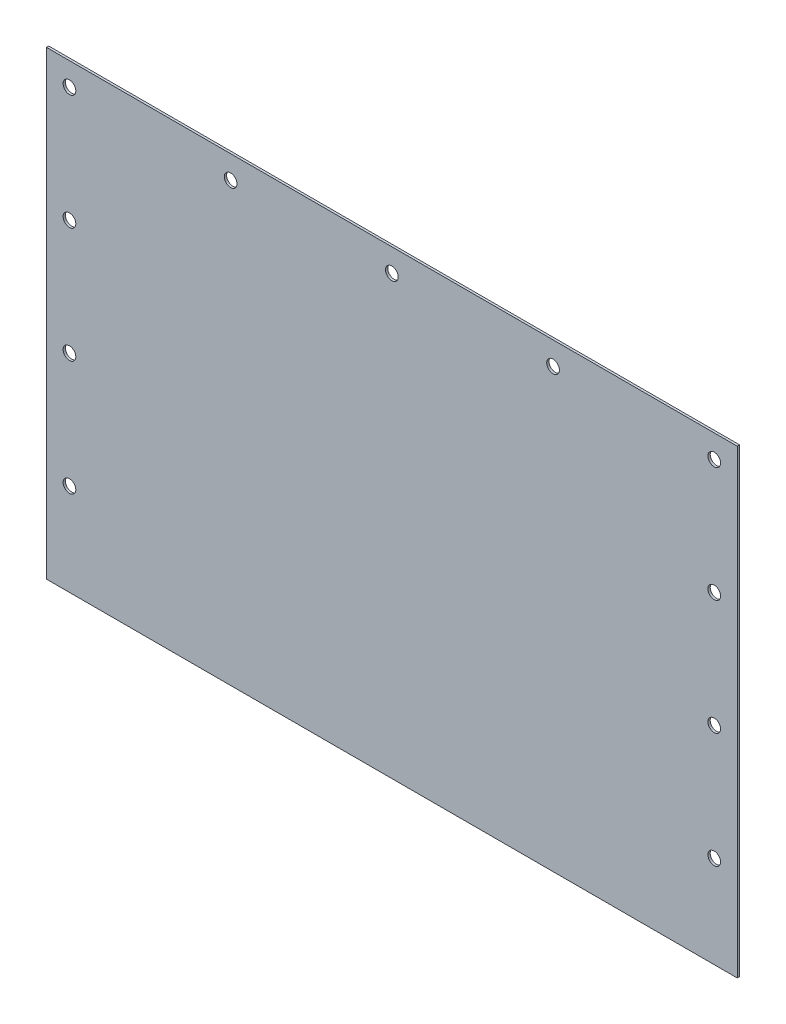
ISO-10303-21;
HEADER;
FILE_DESCRIPTION(('STEP AP214'),'2;1');
FILE_NAME('part.step','',(''),(''),'','','');
FILE_SCHEMA(('AUTOMOTIVE_DESIGN { 1 0 10303 214 1 1 1 1 }'));
ENDSEC;
DATA;
#1=APPLICATION_CONTEXT('core data for automotive mechanical design processes');
#2=APPLICATION_PROTOCOL_DEFINITION('international standard','automotive_design',2000,#1);
#3=PRODUCT_CONTEXT('',#1,'mechanical');
#4=PRODUCT('Part','Part','',(#3));
#5=PRODUCT_RELATED_PRODUCT_CATEGORY('part','',(#4));
#6=PRODUCT_DEFINITION_FORMATION('','',#4);
#7=PRODUCT_DEFINITION_CONTEXT('part definition',#1,'design');
#8=PRODUCT_DEFINITION('design','',#6,#7);
#9=PRODUCT_DEFINITION_SHAPE('','',#8);
#10=(LENGTH_UNIT() NAMED_UNIT(*) SI_UNIT(.MILLI.,.METRE.));
#11=(NAMED_UNIT(*) PLANE_ANGLE_UNIT() SI_UNIT($,.RADIAN.));
#12=(NAMED_UNIT(*) SI_UNIT($,.STERADIAN.) SOLID_ANGLE_UNIT());
#13=UNCERTAINTY_MEASURE_WITH_UNIT(LENGTH_MEASURE(1.E-05),#10,'distance_accuracy_value','');
#14=(GEOMETRIC_REPRESENTATION_CONTEXT(3) GLOBAL_UNCERTAINTY_ASSIGNED_CONTEXT((#13)) GLOBAL_UNIT_ASSIGNED_CONTEXT((#10,
#11,#12)) REPRESENTATION_CONTEXT('',''));
#15=CARTESIAN_POINT('',(0.,0.,0.));
#16=DIRECTION('',(0.,0.,1.));
#17=DIRECTION('',(1.,0.,0.));
#18=AXIS2_PLACEMENT_3D('',#15,#16,#17);
#19=CARTESIAN_POINT('',(-150.,-110.,1.));
#20=DIRECTION('',(-1.,0.,0.));
#21=DIRECTION('',(0.,0.,1.));
#22=AXIS2_PLACEMENT_3D('',#19,#20,#21);
#23=PLANE('',#22);
#24=DIRECTION('',(0.,0.,1.));
#25=VECTOR('',#24,1.);
#26=CARTESIAN_POINT('',(-150.,-89.9999999999999,-9.));
#27=LINE('',#26,#25);
#28=CARTESIAN_POINT('',(-150.,-89.9999999999999,0.));
#29=VERTEX_POINT('',#28);
#30=CARTESIAN_POINT('',(-150.,-89.9999999999999,1.));
#31=VERTEX_POINT('',#30);
#32=EDGE_CURVE('E50',#29,#31,#27,.T.);
#33=ORIENTED_EDGE('',*,*,#32,.T.);
#34=DIRECTION('',(0.,1.,0.));
#35=VECTOR('',#34,1.);
#36=CARTESIAN_POINT('',(-150.,-110.,1.));
#37=LINE('',#36,#35);
#38=CARTESIAN_POINT('',(-150.,110.,1.));
#39=VERTEX_POINT('',#38);
#40=EDGE_CURVE('E81',#31,#39,#37,.T.);
#41=ORIENTED_EDGE('',*,*,#40,.T.);
#42=DIRECTION('',(0.,0.,-1.));
#43=VECTOR('',#42,1.);
#44=CARTESIAN_POINT('',(-150.,110.,1.));
#45=LINE('',#44,#43);
#46=CARTESIAN_POINT('',(-150.,110.,0.));
#47=VERTEX_POINT('',#46);
#48=EDGE_CURVE('E89',#39,#47,#45,.T.);
#49=ORIENTED_EDGE('',*,*,#48,.T.);
#50=DIRECTION('',(0.,1.,0.));
#51=VECTOR('',#50,1.);
#52=CARTESIAN_POINT('',(-150.,-110.,0.));
#53=LINE('',#52,#51);
#54=EDGE_CURVE('E94',#29,#47,#53,.T.);
#55=ORIENTED_EDGE('',*,*,#54,.F.);
#56=EDGE_LOOP('',(#33,#41,#49,#55));
#57=FACE_BOUND('',#56,.T.);
#58=ADVANCED_FACE('F37',(#57),#23,.T.);
#59=CARTESIAN_POINT('',(150.,-110.,1.));
#60=DIRECTION('',(-1.,0.,0.));
#61=DIRECTION('',(0.,0.,1.));
#62=AXIS2_PLACEMENT_3D('',#59,#60,#61);
#63=PLANE('',#62);
#64=DIRECTION('',(0.,1.,0.));
#65=VECTOR('',#64,1.);
#66=CARTESIAN_POINT('',(150.,-110.,1.));
#67=LINE('',#66,#65);
#68=CARTESIAN_POINT('',(150.,-89.9999999999999,1.));
#69=VERTEX_POINT('',#68);
#70=CARTESIAN_POINT('',(150.,110.,1.));
#71=VERTEX_POINT('',#70);
#72=EDGE_CURVE('E59',#69,#71,#67,.T.);
#73=ORIENTED_EDGE('',*,*,#72,.F.);
#74=DIRECTION('',(0.,0.,1.));
#75=VECTOR('',#74,1.);
#76=CARTESIAN_POINT('',(150.,-89.9999999999999,-9.));
#77=LINE('',#76,#75);
#78=CARTESIAN_POINT('',(150.,-89.9999999999999,0.));
#79=VERTEX_POINT('',#78);
#80=EDGE_CURVE('E78',#79,#69,#77,.T.);
#81=ORIENTED_EDGE('',*,*,#80,.F.);
#82=DIRECTION('',(0.,1.,0.));
#83=VECTOR('',#82,1.);
#84=CARTESIAN_POINT('',(150.,-110.,0.));
#85=LINE('',#84,#83);
#86=CARTESIAN_POINT('',(150.,110.,0.));
#87=VERTEX_POINT('',#86);
#88=EDGE_CURVE('E73',#79,#87,#85,.T.);
#89=ORIENTED_EDGE('',*,*,#88,.T.);
#90=DIRECTION('',(0.,0.,-1.));
#91=VECTOR('',#90,1.);
#92=CARTESIAN_POINT('',(150.,110.,1.));
#93=LINE('',#92,#91);
#94=EDGE_CURVE('E44',#71,#87,#93,.T.);
#95=ORIENTED_EDGE('',*,*,#94,.F.);
#96=EDGE_LOOP('',(#73,#81,#89,#95));
#97=FACE_BOUND('',#96,.T.);
#98=ADVANCED_FACE('F75',(#97),#63,.F.);
#99=CARTESIAN_POINT('',(-150.,110.,1.));
#100=DIRECTION('',(0.,1.,0.));
#101=DIRECTION('',(0.,0.,1.));
#102=AXIS2_PLACEMENT_3D('',#99,#100,#101);
#103=PLANE('',#102);
#104=DIRECTION('',(1.,0.,0.));
#105=VECTOR('',#104,1.);
#106=CARTESIAN_POINT('',(-150.,110.,0.));
#107=LINE('',#106,#105);
#108=EDGE_CURVE('E82',#47,#87,#107,.T.);
#109=ORIENTED_EDGE('',*,*,#108,.F.);
#110=ORIENTED_EDGE('',*,*,#48,.F.);
#111=DIRECTION('',(1.,0.,0.));
#112=VECTOR('',#111,1.);
#113=CARTESIAN_POINT('',(-150.,110.,1.));
#114=LINE('',#113,#112);
#115=EDGE_CURVE('E88',#39,#71,#114,.T.);
#116=ORIENTED_EDGE('',*,*,#115,.T.);
#117=ORIENTED_EDGE('',*,*,#94,.T.);
#118=EDGE_LOOP('',(#109,#110,#116,#117));
#119=FACE_BOUND('',#118,.T.);
#120=ADVANCED_FACE('F86',(#119),#103,.T.);
#121=CARTESIAN_POINT('',(0.,0.,1.));
#122=DIRECTION('',(0.,0.,-1.));
#123=DIRECTION('',(-1.,0.,0.));
#124=AXIS2_PLACEMENT_3D('',#121,#122,#123);
#125=PLANE('',#124);
#126=CARTESIAN_POINT('',(140.,100.,1.));
#127=DIRECTION('',(0.,0.,-1.));
#128=DIRECTION('',(-1.,0.,0.));
#129=AXIS2_PLACEMENT_3D('',#126,#127,#128);
#130=CIRCLE('',#129,2.75);
#131=CARTESIAN_POINT('',(137.25,100.,1.));
#132=VERTEX_POINT('',#131);
#133=EDGE_CURVE('E163',#132,#132,#130,.T.);
#134=ORIENTED_EDGE('',*,*,#133,.T.);
#135=EDGE_LOOP('',(#134));
#136=FACE_BOUND('',#135,.T.);
#137=CARTESIAN_POINT('',(70.,100.,1.));
#138=DIRECTION('',(0.,0.,-1.));
#139=DIRECTION('',(-1.,0.,0.));
#140=AXIS2_PLACEMENT_3D('',#137,#138,#139);
#141=CIRCLE('',#140,2.75);
#142=CARTESIAN_POINT('',(67.2499999999999,100.,1.));
#143=VERTEX_POINT('',#142);
#144=EDGE_CURVE('E157',#143,#143,#141,.T.);
#145=ORIENTED_EDGE('',*,*,#144,.T.);
#146=EDGE_LOOP('',(#145));
#147=FACE_BOUND('',#146,.T.);
#148=CARTESIAN_POINT('',(-70.,100.,1.));
#149=DIRECTION('',(0.,0.,-1.));
#150=DIRECTION('',(-1.,0.,0.));
#151=AXIS2_PLACEMENT_3D('',#148,#149,#150);
#152=CIRCLE('',#151,2.75);
#153=CARTESIAN_POINT('',(-72.75,100.,1.));
#154=VERTEX_POINT('',#153);
#155=EDGE_CURVE('E151',#154,#154,#152,.T.);
#156=ORIENTED_EDGE('',*,*,#155,.T.);
#157=EDGE_LOOP('',(#156));
#158=FACE_BOUND('',#157,.T.);
#159=CARTESIAN_POINT('',(0.,100.,1.));
#160=DIRECTION('',(0.,0.,-1.));
#161=DIRECTION('',(-1.,0.,0.));
#162=AXIS2_PLACEMENT_3D('',#159,#160,#161);
#163=CIRCLE('',#162,2.75);
#164=CARTESIAN_POINT('',(-2.75,100.,1.));
#165=VERTEX_POINT('',#164);
#166=EDGE_CURVE('E145',#165,#165,#163,.T.);
#167=ORIENTED_EDGE('',*,*,#166,.T.);
#168=EDGE_LOOP('',(#167));
#169=FACE_BOUND('',#168,.T.);
#170=CARTESIAN_POINT('',(-140.,100.,1.));
#171=DIRECTION('',(0.,0.,-1.));
#172=DIRECTION('',(-1.,0.,0.));
#173=AXIS2_PLACEMENT_3D('',#170,#171,#172);
#174=CIRCLE('',#173,2.75);
#175=CARTESIAN_POINT('',(-142.75,100.,1.));
#176=VERTEX_POINT('',#175);
#177=EDGE_CURVE('E139',#176,#176,#174,.T.);
#178=ORIENTED_EDGE('',*,*,#177,.T.);
#179=EDGE_LOOP('',(#178));
#180=FACE_BOUND('',#179,.T.);
#181=CARTESIAN_POINT('',(-140.,50.,1.));
#182=DIRECTION('',(0.,0.,-1.));
#183=DIRECTION('',(-1.,0.,0.));
#184=AXIS2_PLACEMENT_3D('',#181,#182,#183);
#185=CIRCLE('',#184,2.75);
#186=CARTESIAN_POINT('',(-142.75,50.,1.));
#187=VERTEX_POINT('',#186);
#188=EDGE_CURVE('E133',#187,#187,#185,.T.);
#189=ORIENTED_EDGE('',*,*,#188,.T.);
#190=EDGE_LOOP('',(#189));
#191=FACE_BOUND('',#190,.T.);
#192=CARTESIAN_POINT('',(-140.,-50.,1.));
#193=DIRECTION('',(0.,0.,-1.));
#194=DIRECTION('',(-1.,0.,0.));
#195=AXIS2_PLACEMENT_3D('',#192,#193,#194);
#196=CIRCLE('',#195,2.75);
#197=CARTESIAN_POINT('',(-142.75,-50.,1.));
#198=VERTEX_POINT('',#197);
#199=EDGE_CURVE('E127',#198,#198,#196,.T.);
#200=ORIENTED_EDGE('',*,*,#199,.T.);
#201=EDGE_LOOP('',(#200));
#202=FACE_BOUND('',#201,.T.);
#203=CARTESIAN_POINT('',(-140.,0.,1.));
#204=DIRECTION('',(0.,0.,-1.));
#205=DIRECTION('',(-1.,0.,0.));
#206=AXIS2_PLACEMENT_3D('',#203,#204,#205);
#207=CIRCLE('',#206,2.75);
#208=CARTESIAN_POINT('',(-142.75,0.,1.));
#209=VERTEX_POINT('',#208);
#210=EDGE_CURVE('E121',#209,#209,#207,.T.);
#211=ORIENTED_EDGE('',*,*,#210,.T.);
#212=EDGE_LOOP('',(#211));
#213=FACE_BOUND('',#212,.T.);
#214=CARTESIAN_POINT('',(140.,50.0000000000001,1.));
#215=DIRECTION('',(0.,0.,-1.));
#216=DIRECTION('',(-1.,0.,0.));
#217=AXIS2_PLACEMENT_3D('',#214,#215,#216);
#218=CIRCLE('',#217,2.75);
#219=CARTESIAN_POINT('',(137.25,50.0000000000001,1.));
#220=VERTEX_POINT('',#219);
#221=EDGE_CURVE('E115',#220,#220,#218,.T.);
#222=ORIENTED_EDGE('',*,*,#221,.T.);
#223=EDGE_LOOP('',(#222));
#224=FACE_BOUND('',#223,.T.);
#225=CARTESIAN_POINT('',(140.,-50.,1.));
#226=DIRECTION('',(0.,0.,-1.));
#227=DIRECTION('',(-1.,0.,0.));
#228=AXIS2_PLACEMENT_3D('',#225,#226,#227);
#229=CIRCLE('',#228,2.75);
#230=CARTESIAN_POINT('',(137.25,-50.,1.));
#231=VERTEX_POINT('',#230);
#232=EDGE_CURVE('E109',#231,#231,#229,.T.);
#233=ORIENTED_EDGE('',*,*,#232,.T.);
#234=EDGE_LOOP('',(#233));
#235=FACE_BOUND('',#234,.T.);
#236=CARTESIAN_POINT('',(140.,0.,1.));
#237=DIRECTION('',(0.,0.,-1.));
#238=DIRECTION('',(-1.,0.,0.));
#239=AXIS2_PLACEMENT_3D('',#236,#237,#238);
#240=CIRCLE('',#239,2.75);
#241=CARTESIAN_POINT('',(137.25,0.,1.));
#242=VERTEX_POINT('',#241);
#243=EDGE_CURVE('E97',#242,#242,#240,.T.);
#244=ORIENTED_EDGE('',*,*,#243,.T.);
#245=EDGE_LOOP('',(#244));
#246=FACE_BOUND('',#245,.T.);
#247=ORIENTED_EDGE('',*,*,#40,.F.);
#248=DIRECTION('',(-1.,0.,0.));
#249=VECTOR('',#248,1.);
#250=CARTESIAN_POINT('',(-150.,-89.9999999999999,1.));
#251=LINE('',#250,#249);
#252=EDGE_CURVE('E170',#69,#31,#251,.T.);
#253=ORIENTED_EDGE('',*,*,#252,.F.);
#254=ORIENTED_EDGE('',*,*,#72,.T.);
#255=ORIENTED_EDGE('',*,*,#115,.F.);
#256=EDGE_LOOP('',(#247,#253,#254,#255));
#257=FACE_BOUND('',#256,.T.);
#258=ADVANCED_FACE('F177',(#136,#147,#158,#169,#180,#191,#202,#213,#224,#235,#246,#257),#125,.F.);
#259=CARTESIAN_POINT('',(0.,0.,0.));
#260=DIRECTION('',(0.,0.,-1.));
#261=DIRECTION('',(-1.,0.,0.));
#262=AXIS2_PLACEMENT_3D('',#259,#260,#261);
#263=PLANE('',#262);
#264=DIRECTION('',(1.,0.,0.));
#265=VECTOR('',#264,1.);
#266=CARTESIAN_POINT('',(0.,-89.9999999999999,0.));
#267=LINE('',#266,#265);
#268=EDGE_CURVE('E11',#29,#79,#267,.T.);
#269=ORIENTED_EDGE('',*,*,#268,.F.);
#270=ORIENTED_EDGE('',*,*,#54,.T.);
#271=ORIENTED_EDGE('',*,*,#108,.T.);
#272=ORIENTED_EDGE('',*,*,#88,.F.);
#273=EDGE_LOOP('',(#269,#270,#271,#272));
#274=FACE_BOUND('',#273,.T.);
#275=CARTESIAN_POINT('',(140.,100.,0.));
#276=DIRECTION('',(0.,0.,-1.));
#277=DIRECTION('',(-1.,0.,0.));
#278=AXIS2_PLACEMENT_3D('',#275,#276,#277);
#279=CIRCLE('',#278,2.75);
#280=CARTESIAN_POINT('',(137.25,100.,0.));
#281=VERTEX_POINT('',#280);
#282=EDGE_CURVE('E166',#281,#281,#279,.T.);
#283=ORIENTED_EDGE('',*,*,#282,.F.);
#284=EDGE_LOOP('',(#283));
#285=FACE_BOUND('',#284,.T.);
#286=CARTESIAN_POINT('',(70.,100.,0.));
#287=DIRECTION('',(0.,0.,-1.));
#288=DIRECTION('',(-1.,0.,0.));
#289=AXIS2_PLACEMENT_3D('',#286,#287,#288);
#290=CIRCLE('',#289,2.75);
#291=CARTESIAN_POINT('',(67.2499999999999,100.,0.));
#292=VERTEX_POINT('',#291);
#293=EDGE_CURVE('E160',#292,#292,#290,.T.);
#294=ORIENTED_EDGE('',*,*,#293,.F.);
#295=EDGE_LOOP('',(#294));
#296=FACE_BOUND('',#295,.T.);
#297=CARTESIAN_POINT('',(-70.,100.,0.));
#298=DIRECTION('',(0.,0.,-1.));
#299=DIRECTION('',(-1.,0.,0.));
#300=AXIS2_PLACEMENT_3D('',#297,#298,#299);
#301=CIRCLE('',#300,2.75);
#302=CARTESIAN_POINT('',(-72.75,100.,0.));
#303=VERTEX_POINT('',#302);
#304=EDGE_CURVE('E154',#303,#303,#301,.T.);
#305=ORIENTED_EDGE('',*,*,#304,.F.);
#306=EDGE_LOOP('',(#305));
#307=FACE_BOUND('',#306,.T.);
#308=CARTESIAN_POINT('',(0.,100.,0.));
#309=DIRECTION('',(0.,0.,-1.));
#310=DIRECTION('',(-1.,0.,0.));
#311=AXIS2_PLACEMENT_3D('',#308,#309,#310);
#312=CIRCLE('',#311,2.75);
#313=CARTESIAN_POINT('',(-2.75,100.,0.));
#314=VERTEX_POINT('',#313);
#315=EDGE_CURVE('E148',#314,#314,#312,.T.);
#316=ORIENTED_EDGE('',*,*,#315,.F.);
#317=EDGE_LOOP('',(#316));
#318=FACE_BOUND('',#317,.T.);
#319=CARTESIAN_POINT('',(-140.,100.,0.));
#320=DIRECTION('',(0.,0.,-1.));
#321=DIRECTION('',(-1.,0.,0.));
#322=AXIS2_PLACEMENT_3D('',#319,#320,#321);
#323=CIRCLE('',#322,2.75);
#324=CARTESIAN_POINT('',(-142.75,100.,0.));
#325=VERTEX_POINT('',#324);
#326=EDGE_CURVE('E142',#325,#325,#323,.T.);
#327=ORIENTED_EDGE('',*,*,#326,.F.);
#328=EDGE_LOOP('',(#327));
#329=FACE_BOUND('',#328,.T.);
#330=CARTESIAN_POINT('',(-140.,50.,0.));
#331=DIRECTION('',(0.,0.,-1.));
#332=DIRECTION('',(-1.,0.,0.));
#333=AXIS2_PLACEMENT_3D('',#330,#331,#332);
#334=CIRCLE('',#333,2.75);
#335=CARTESIAN_POINT('',(-142.75,50.,0.));
#336=VERTEX_POINT('',#335);
#337=EDGE_CURVE('E136',#336,#336,#334,.T.);
#338=ORIENTED_EDGE('',*,*,#337,.F.);
#339=EDGE_LOOP('',(#338));
#340=FACE_BOUND('',#339,.T.);
#341=CARTESIAN_POINT('',(-140.,-50.,0.));
#342=DIRECTION('',(0.,0.,-1.));
#343=DIRECTION('',(-1.,0.,0.));
#344=AXIS2_PLACEMENT_3D('',#341,#342,#343);
#345=CIRCLE('',#344,2.75);
#346=CARTESIAN_POINT('',(-142.75,-50.,0.));
#347=VERTEX_POINT('',#346);
#348=EDGE_CURVE('E130',#347,#347,#345,.T.);
#349=ORIENTED_EDGE('',*,*,#348,.F.);
#350=EDGE_LOOP('',(#349));
#351=FACE_BOUND('',#350,.T.);
#352=CARTESIAN_POINT('',(-140.,0.,0.));
#353=DIRECTION('',(0.,0.,-1.));
#354=DIRECTION('',(-1.,0.,0.));
#355=AXIS2_PLACEMENT_3D('',#352,#353,#354);
#356=CIRCLE('',#355,2.75);
#357=CARTESIAN_POINT('',(-142.75,0.,0.));
#358=VERTEX_POINT('',#357);
#359=EDGE_CURVE('E124',#358,#358,#356,.T.);
#360=ORIENTED_EDGE('',*,*,#359,.F.);
#361=EDGE_LOOP('',(#360));
#362=FACE_BOUND('',#361,.T.);
#363=CARTESIAN_POINT('',(140.,50.0000000000001,0.));
#364=DIRECTION('',(0.,0.,-1.));
#365=DIRECTION('',(-1.,0.,0.));
#366=AXIS2_PLACEMENT_3D('',#363,#364,#365);
#367=CIRCLE('',#366,2.75);
#368=CARTESIAN_POINT('',(137.25,50.0000000000001,0.));
#369=VERTEX_POINT('',#368);
#370=EDGE_CURVE('E118',#369,#369,#367,.T.);
#371=ORIENTED_EDGE('',*,*,#370,.F.);
#372=EDGE_LOOP('',(#371));
#373=FACE_BOUND('',#372,.T.);
#374=CARTESIAN_POINT('',(140.,-50.,0.));
#375=DIRECTION('',(0.,0.,-1.));
#376=DIRECTION('',(-1.,0.,0.));
#377=AXIS2_PLACEMENT_3D('',#374,#375,#376);
#378=CIRCLE('',#377,2.75);
#379=CARTESIAN_POINT('',(137.25,-50.,0.));
#380=VERTEX_POINT('',#379);
#381=EDGE_CURVE('E112',#380,#380,#378,.T.);
#382=ORIENTED_EDGE('',*,*,#381,.F.);
#383=EDGE_LOOP('',(#382));
#384=FACE_BOUND('',#383,.T.);
#385=CARTESIAN_POINT('',(140.,0.,0.));
#386=DIRECTION('',(0.,0.,-1.));
#387=DIRECTION('',(-1.,0.,0.));
#388=AXIS2_PLACEMENT_3D('',#385,#386,#387);
#389=CIRCLE('',#388,2.75);
#390=CARTESIAN_POINT('',(137.25,0.,0.));
#391=VERTEX_POINT('',#390);
#392=EDGE_CURVE('E106',#391,#391,#389,.T.);
#393=ORIENTED_EDGE('',*,*,#392,.F.);
#394=EDGE_LOOP('',(#393));
#395=FACE_BOUND('',#394,.T.);
#396=ADVANCED_FACE('F91',(#274,#285,#296,#307,#318,#329,#340,#351,#362,#373,#384,#395),#263,.T.);
#397=CARTESIAN_POINT('',(140.,0.,0.));
#398=DIRECTION('',(0.,0.,-1.));
#399=DIRECTION('',(-1.,0.,0.));
#400=AXIS2_PLACEMENT_3D('',#397,#398,#399);
#401=CYLINDRICAL_SURFACE('',#400,2.75);
#402=ORIENTED_EDGE('',*,*,#243,.F.);
#403=EDGE_LOOP('',(#402));
#404=FACE_BOUND('',#403,.T.);
#405=ORIENTED_EDGE('',*,*,#392,.T.);
#406=EDGE_LOOP('',(#405));
#407=FACE_BOUND('',#406,.T.);
#408=ADVANCED_FACE('F185',(#404,#407),#401,.F.);
#409=CARTESIAN_POINT('',(140.,-50.,0.));
#410=DIRECTION('',(0.,0.,-1.));
#411=DIRECTION('',(-1.,0.,0.));
#412=AXIS2_PLACEMENT_3D('',#409,#410,#411);
#413=CYLINDRICAL_SURFACE('',#412,2.75);
#414=ORIENTED_EDGE('',*,*,#232,.F.);
#415=EDGE_LOOP('',(#414));
#416=FACE_BOUND('',#415,.T.);
#417=ORIENTED_EDGE('',*,*,#381,.T.);
#418=EDGE_LOOP('',(#417));
#419=FACE_BOUND('',#418,.T.);
#420=ADVANCED_FACE('F211',(#416,#419),#413,.F.);
#421=CARTESIAN_POINT('',(140.,50.0000000000001,0.));
#422=DIRECTION('',(0.,0.,-1.));
#423=DIRECTION('',(-1.,0.,0.));
#424=AXIS2_PLACEMENT_3D('',#421,#422,#423);
#425=CYLINDRICAL_SURFACE('',#424,2.75);
#426=ORIENTED_EDGE('',*,*,#221,.F.);
#427=EDGE_LOOP('',(#426));
#428=FACE_BOUND('',#427,.T.);
#429=ORIENTED_EDGE('',*,*,#370,.T.);
#430=EDGE_LOOP('',(#429));
#431=FACE_BOUND('',#430,.T.);
#432=ADVANCED_FACE('F222',(#428,#431),#425,.F.);
#433=CARTESIAN_POINT('',(-140.,0.,0.));
#434=DIRECTION('',(0.,0.,-1.));
#435=DIRECTION('',(-1.,0.,0.));
#436=AXIS2_PLACEMENT_3D('',#433,#434,#435);
#437=CYLINDRICAL_SURFACE('',#436,2.75);
#438=ORIENTED_EDGE('',*,*,#210,.F.);
#439=EDGE_LOOP('',(#438));
#440=FACE_BOUND('',#439,.T.);
#441=ORIENTED_EDGE('',*,*,#359,.T.);
#442=EDGE_LOOP('',(#441));
#443=FACE_BOUND('',#442,.T.);
#444=ADVANCED_FACE('F233',(#440,#443),#437,.F.);
#445=CARTESIAN_POINT('',(-140.,-50.,0.));
#446=DIRECTION('',(0.,0.,-1.));
#447=DIRECTION('',(-1.,0.,0.));
#448=AXIS2_PLACEMENT_3D('',#445,#446,#447);
#449=CYLINDRICAL_SURFACE('',#448,2.75);
#450=ORIENTED_EDGE('',*,*,#199,.F.);
#451=EDGE_LOOP('',(#450));
#452=FACE_BOUND('',#451,.T.);
#453=ORIENTED_EDGE('',*,*,#348,.T.);
#454=EDGE_LOOP('',(#453));
#455=FACE_BOUND('',#454,.T.);
#456=ADVANCED_FACE('F244',(#452,#455),#449,.F.);
#457=CARTESIAN_POINT('',(-140.,50.,0.));
#458=DIRECTION('',(0.,0.,-1.));
#459=DIRECTION('',(-1.,0.,0.));
#460=AXIS2_PLACEMENT_3D('',#457,#458,#459);
#461=CYLINDRICAL_SURFACE('',#460,2.75);
#462=ORIENTED_EDGE('',*,*,#188,.F.);
#463=EDGE_LOOP('',(#462));
#464=FACE_BOUND('',#463,.T.);
#465=ORIENTED_EDGE('',*,*,#337,.T.);
#466=EDGE_LOOP('',(#465));
#467=FACE_BOUND('',#466,.T.);
#468=ADVANCED_FACE('F255',(#464,#467),#461,.F.);
#469=CARTESIAN_POINT('',(-140.,100.,0.));
#470=DIRECTION('',(0.,0.,-1.));
#471=DIRECTION('',(-1.,0.,0.));
#472=AXIS2_PLACEMENT_3D('',#469,#470,#471);
#473=CYLINDRICAL_SURFACE('',#472,2.75);
#474=ORIENTED_EDGE('',*,*,#177,.F.);
#475=EDGE_LOOP('',(#474));
#476=FACE_BOUND('',#475,.T.);
#477=ORIENTED_EDGE('',*,*,#326,.T.);
#478=EDGE_LOOP('',(#477));
#479=FACE_BOUND('',#478,.T.);
#480=ADVANCED_FACE('F266',(#476,#479),#473,.F.);
#481=CARTESIAN_POINT('',(0.,100.,0.));
#482=DIRECTION('',(0.,0.,-1.));
#483=DIRECTION('',(-1.,0.,0.));
#484=AXIS2_PLACEMENT_3D('',#481,#482,#483);
#485=CYLINDRICAL_SURFACE('',#484,2.75);
#486=ORIENTED_EDGE('',*,*,#166,.F.);
#487=EDGE_LOOP('',(#486));
#488=FACE_BOUND('',#487,.T.);
#489=ORIENTED_EDGE('',*,*,#315,.T.);
#490=EDGE_LOOP('',(#489));
#491=FACE_BOUND('',#490,.T.);
#492=ADVANCED_FACE('F277',(#488,#491),#485,.F.);
#493=CARTESIAN_POINT('',(-70.,100.,0.));
#494=DIRECTION('',(0.,0.,-1.));
#495=DIRECTION('',(-1.,0.,0.));
#496=AXIS2_PLACEMENT_3D('',#493,#494,#495);
#497=CYLINDRICAL_SURFACE('',#496,2.75);
#498=ORIENTED_EDGE('',*,*,#155,.F.);
#499=EDGE_LOOP('',(#498));
#500=FACE_BOUND('',#499,.T.);
#501=ORIENTED_EDGE('',*,*,#304,.T.);
#502=EDGE_LOOP('',(#501));
#503=FACE_BOUND('',#502,.T.);
#504=ADVANCED_FACE('F288',(#500,#503),#497,.F.);
#505=CARTESIAN_POINT('',(70.,100.,0.));
#506=DIRECTION('',(0.,0.,-1.));
#507=DIRECTION('',(-1.,0.,0.));
#508=AXIS2_PLACEMENT_3D('',#505,#506,#507);
#509=CYLINDRICAL_SURFACE('',#508,2.75);
#510=ORIENTED_EDGE('',*,*,#144,.F.);
#511=EDGE_LOOP('',(#510));
#512=FACE_BOUND('',#511,.T.);
#513=ORIENTED_EDGE('',*,*,#293,.T.);
#514=EDGE_LOOP('',(#513));
#515=FACE_BOUND('',#514,.T.);
#516=ADVANCED_FACE('F299',(#512,#515),#509,.F.);
#517=CARTESIAN_POINT('',(140.,100.,0.));
#518=DIRECTION('',(0.,0.,-1.));
#519=DIRECTION('',(-1.,0.,0.));
#520=AXIS2_PLACEMENT_3D('',#517,#518,#519);
#521=CYLINDRICAL_SURFACE('',#520,2.75);
#522=ORIENTED_EDGE('',*,*,#133,.F.);
#523=EDGE_LOOP('',(#522));
#524=FACE_BOUND('',#523,.T.);
#525=ORIENTED_EDGE('',*,*,#282,.T.);
#526=EDGE_LOOP('',(#525));
#527=FACE_BOUND('',#526,.T.);
#528=ADVANCED_FACE('F310',(#524,#527),#521,.F.);
#529=CARTESIAN_POINT('',(-150.,-89.9999999999999,-9.));
#530=DIRECTION('',(0.,1.,0.));
#531=DIRECTION('',(0.,0.,1.));
#532=AXIS2_PLACEMENT_3D('',#529,#530,#531);
#533=PLANE('',#532);
#534=ORIENTED_EDGE('',*,*,#268,.T.);
#535=ORIENTED_EDGE('',*,*,#80,.T.);
#536=ORIENTED_EDGE('',*,*,#252,.T.);
#537=ORIENTED_EDGE('',*,*,#32,.F.);
#538=EDGE_LOOP('',(#534,#535,#536,#537));
#539=FACE_BOUND('',#538,.T.);
#540=ADVANCED_FACE('F173',(#539),#533,.F.);
#541=CLOSED_SHELL('',(#58,#98,#120,#258,#396,#408,#420,#432,#444,#456,#468,#480,#492,#504,#516,
#528,#540));
#542=MANIFOLD_SOLID_BREP('B2',#541);
#543=ADVANCED_BREP_SHAPE_REPRESENTATION('',(#18,#542),#14);
#544=SHAPE_DEFINITION_REPRESENTATION(#9,#543);
ENDSEC;
END-ISO-10303-21;
